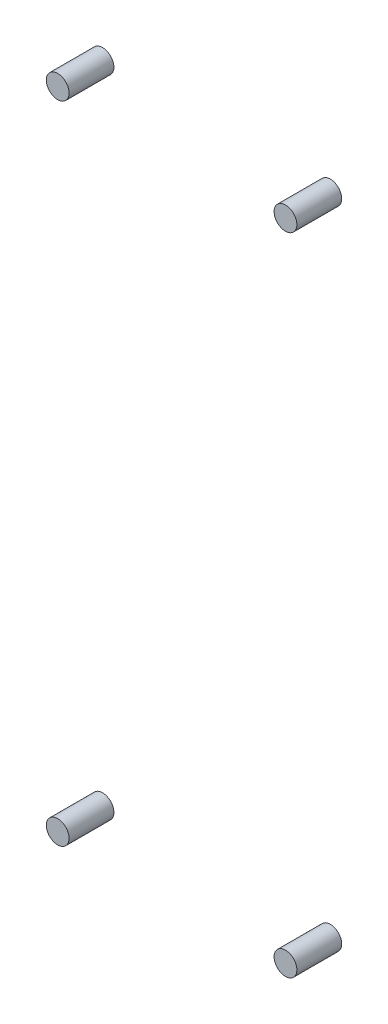
ISO-10303-21;
HEADER;
FILE_DESCRIPTION(('STEP AP214'),'2;1');
FILE_NAME('part.step','',(''),(''),'','','');
FILE_SCHEMA(('AUTOMOTIVE_DESIGN { 1 0 10303 214 1 1 1 1 }'));
ENDSEC;
DATA;
#1=APPLICATION_CONTEXT('core data for automotive mechanical design processes');
#2=APPLICATION_PROTOCOL_DEFINITION('international standard','automotive_design',2000,#1);
#3=PRODUCT_CONTEXT('',#1,'mechanical');
#4=PRODUCT('Part','Part','',(#3));
#5=PRODUCT_RELATED_PRODUCT_CATEGORY('part','',(#4));
#6=PRODUCT_DEFINITION_FORMATION('','',#4);
#7=PRODUCT_DEFINITION_CONTEXT('part definition',#1,'design');
#8=PRODUCT_DEFINITION('design','',#6,#7);
#9=PRODUCT_DEFINITION_SHAPE('','',#8);
#10=(LENGTH_UNIT() NAMED_UNIT(*) SI_UNIT(.MILLI.,.METRE.));
#11=(NAMED_UNIT(*) PLANE_ANGLE_UNIT() SI_UNIT($,.RADIAN.));
#12=(NAMED_UNIT(*) SI_UNIT($,.STERADIAN.) SOLID_ANGLE_UNIT());
#13=UNCERTAINTY_MEASURE_WITH_UNIT(LENGTH_MEASURE(1.E-05),#10,'distance_accuracy_value','');
#14=(GEOMETRIC_REPRESENTATION_CONTEXT(3) GLOBAL_UNCERTAINTY_ASSIGNED_CONTEXT((#13)) GLOBAL_UNIT_ASSIGNED_CONTEXT((#10,
#11,#12)) REPRESENTATION_CONTEXT('',''));
#15=CARTESIAN_POINT('',(0.,0.,0.));
#16=DIRECTION('',(0.,0.,1.));
#17=DIRECTION('',(1.,0.,0.));
#18=AXIS2_PLACEMENT_3D('',#15,#16,#17);
#19=CARTESIAN_POINT('',(-7.62,-21.59,3.));
#20=DIRECTION('',(0.,0.,-1.));
#21=DIRECTION('',(-1.,0.,0.));
#22=AXIS2_PLACEMENT_3D('',#19,#20,#21);
#23=CYLINDRICAL_SURFACE('',#22,0.761999999999999);
#24=CARTESIAN_POINT('',(-7.62,-21.59,3.));
#25=DIRECTION('',(0.,0.,1.));
#26=DIRECTION('',(-1.,0.,0.));
#27=AXIS2_PLACEMENT_3D('',#24,#25,#26);
#28=CIRCLE('',#27,0.761999999999999);
#29=CARTESIAN_POINT('',(-8.382,-21.59,3.));
#30=VERTEX_POINT('',#29);
#31=EDGE_CURVE('E11',#30,#30,#28,.T.);
#32=ORIENTED_EDGE('',*,*,#31,.F.);
#33=EDGE_LOOP('',(#32));
#34=FACE_BOUND('',#33,.T.);
#35=CARTESIAN_POINT('',(-7.62,-21.59,0.));
#36=DIRECTION('',(0.,0.,1.));
#37=DIRECTION('',(-1.,0.,0.));
#38=AXIS2_PLACEMENT_3D('',#35,#36,#37);
#39=CIRCLE('',#38,0.761999999999999);
#40=CARTESIAN_POINT('',(-8.382,-21.59,0.));
#41=VERTEX_POINT('',#40);
#42=EDGE_CURVE('E43',#41,#41,#39,.T.);
#43=ORIENTED_EDGE('',*,*,#42,.T.);
#44=EDGE_LOOP('',(#43));
#45=FACE_BOUND('',#44,.T.);
#46=ADVANCED_FACE('F40',(#34,#45),#23,.T.);
#47=CARTESIAN_POINT('',(-7.62,-21.59,3.));
#48=DIRECTION('',(0.,0.,-1.));
#49=DIRECTION('',(-1.,0.,0.));
#50=AXIS2_PLACEMENT_3D('',#47,#48,#49);
#51=PLANE('',#50);
#52=ORIENTED_EDGE('',*,*,#31,.T.);
#53=EDGE_LOOP('',(#52));
#54=FACE_BOUND('',#53,.T.);
#55=ADVANCED_FACE('F55',(#54),#51,.F.);
#56=CARTESIAN_POINT('',(-7.62,-21.59,0.));
#57=DIRECTION('',(0.,0.,-1.));
#58=DIRECTION('',(-1.,0.,0.));
#59=AXIS2_PLACEMENT_3D('',#56,#57,#58);
#60=PLANE('',#59);
#61=ORIENTED_EDGE('',*,*,#42,.F.);
#62=EDGE_LOOP('',(#61));
#63=FACE_BOUND('',#62,.T.);
#64=ADVANCED_FACE('F53',(#63),#60,.T.);
#65=CLOSED_SHELL('',(#46,#55,#64));
#66=MANIFOLD_SOLID_BREP('B2',#65);
#67=CARTESIAN_POINT('',(7.62,-21.59,3.));
#68=DIRECTION('',(0.,0.,-1.));
#69=DIRECTION('',(-1.,0.,0.));
#70=AXIS2_PLACEMENT_3D('',#67,#68,#69);
#71=CYLINDRICAL_SURFACE('',#70,0.762);
#72=CARTESIAN_POINT('',(7.62,-21.59,3.));
#73=DIRECTION('',(0.,0.,1.));
#74=DIRECTION('',(-1.,0.,0.));
#75=AXIS2_PLACEMENT_3D('',#72,#73,#74);
#76=CIRCLE('',#75,0.762);
#77=CARTESIAN_POINT('',(6.858,-21.59,3.));
#78=VERTEX_POINT('',#77);
#79=EDGE_CURVE('E39',#78,#78,#76,.T.);
#80=ORIENTED_EDGE('',*,*,#79,.F.);
#81=EDGE_LOOP('',(#80));
#82=FACE_BOUND('',#81,.T.);
#83=CARTESIAN_POINT('',(7.62,-21.59,0.));
#84=DIRECTION('',(0.,0.,1.));
#85=DIRECTION('',(-1.,0.,0.));
#86=AXIS2_PLACEMENT_3D('',#83,#84,#85);
#87=CIRCLE('',#86,0.762);
#88=CARTESIAN_POINT('',(6.858,-21.59,0.));
#89=VERTEX_POINT('',#88);
#90=EDGE_CURVE('E92',#89,#89,#87,.T.);
#91=ORIENTED_EDGE('',*,*,#90,.T.);
#92=EDGE_LOOP('',(#91));
#93=FACE_BOUND('',#92,.T.);
#94=ADVANCED_FACE('F89',(#82,#93),#71,.T.);
#95=CARTESIAN_POINT('',(7.62,-21.59,3.));
#96=DIRECTION('',(0.,0.,-1.));
#97=DIRECTION('',(-1.,0.,0.));
#98=AXIS2_PLACEMENT_3D('',#95,#96,#97);
#99=PLANE('',#98);
#100=ORIENTED_EDGE('',*,*,#79,.T.);
#101=EDGE_LOOP('',(#100));
#102=FACE_BOUND('',#101,.T.);
#103=ADVANCED_FACE('F104',(#102),#99,.F.);
#104=CARTESIAN_POINT('',(7.62,-21.59,0.));
#105=DIRECTION('',(0.,0.,-1.));
#106=DIRECTION('',(-1.,0.,0.));
#107=AXIS2_PLACEMENT_3D('',#104,#105,#106);
#108=PLANE('',#107);
#109=ORIENTED_EDGE('',*,*,#90,.F.);
#110=EDGE_LOOP('',(#109));
#111=FACE_BOUND('',#110,.T.);
#112=ADVANCED_FACE('F102',(#111),#108,.T.);
#113=CLOSED_SHELL('',(#94,#103,#112));
#114=MANIFOLD_SOLID_BREP('B6',#113);
#115=CARTESIAN_POINT('',(7.62,21.59,3.));
#116=DIRECTION('',(0.,0.,-1.));
#117=DIRECTION('',(-1.,0.,0.));
#118=AXIS2_PLACEMENT_3D('',#115,#116,#117);
#119=CYLINDRICAL_SURFACE('',#118,0.762);
#120=CARTESIAN_POINT('',(7.62,21.59,3.));
#121=DIRECTION('',(0.,0.,1.));
#122=DIRECTION('',(1.,0.,0.));
#123=AXIS2_PLACEMENT_3D('',#120,#121,#122);
#124=CIRCLE('',#123,0.762);
#125=CARTESIAN_POINT('',(8.382,21.59,3.));
#126=VERTEX_POINT('',#125);
#127=EDGE_CURVE('E88',#126,#126,#124,.T.);
#128=ORIENTED_EDGE('',*,*,#127,.F.);
#129=EDGE_LOOP('',(#128));
#130=FACE_BOUND('',#129,.T.);
#131=CARTESIAN_POINT('',(7.62,21.59,0.));
#132=DIRECTION('',(0.,0.,1.));
#133=DIRECTION('',(1.,0.,0.));
#134=AXIS2_PLACEMENT_3D('',#131,#132,#133);
#135=CIRCLE('',#134,0.762);
#136=CARTESIAN_POINT('',(8.382,21.59,0.));
#137=VERTEX_POINT('',#136);
#138=EDGE_CURVE('E140',#137,#137,#135,.T.);
#139=ORIENTED_EDGE('',*,*,#138,.T.);
#140=EDGE_LOOP('',(#139));
#141=FACE_BOUND('',#140,.T.);
#142=ADVANCED_FACE('F137',(#130,#141),#119,.T.);
#143=CARTESIAN_POINT('',(7.62,21.59,3.));
#144=DIRECTION('',(0.,0.,1.));
#145=DIRECTION('',(1.,0.,0.));
#146=AXIS2_PLACEMENT_3D('',#143,#144,#145);
#147=PLANE('',#146);
#148=ORIENTED_EDGE('',*,*,#127,.T.);
#149=EDGE_LOOP('',(#148));
#150=FACE_BOUND('',#149,.T.);
#151=ADVANCED_FACE('F152',(#150),#147,.T.);
#152=CARTESIAN_POINT('',(7.62,21.59,0.));
#153=DIRECTION('',(0.,0.,1.));
#154=DIRECTION('',(1.,0.,0.));
#155=AXIS2_PLACEMENT_3D('',#152,#153,#154);
#156=PLANE('',#155);
#157=ORIENTED_EDGE('',*,*,#138,.F.);
#158=EDGE_LOOP('',(#157));
#159=FACE_BOUND('',#158,.T.);
#160=ADVANCED_FACE('F150',(#159),#156,.F.);
#161=CLOSED_SHELL('',(#142,#151,#160));
#162=MANIFOLD_SOLID_BREP('B34',#161);
#163=CARTESIAN_POINT('',(-7.62,21.59,3.));
#164=DIRECTION('',(0.,0.,-1.));
#165=DIRECTION('',(-1.,0.,0.));
#166=AXIS2_PLACEMENT_3D('',#163,#164,#165);
#167=CYLINDRICAL_SURFACE('',#166,0.761999999999999);
#168=CARTESIAN_POINT('',(-7.62,21.59,3.));
#169=DIRECTION('',(0.,0.,1.));
#170=DIRECTION('',(1.,0.,0.));
#171=AXIS2_PLACEMENT_3D('',#168,#169,#170);
#172=CIRCLE('',#171,0.761999999999999);
#173=CARTESIAN_POINT('',(-6.858,21.59,3.));
#174=VERTEX_POINT('',#173);
#175=EDGE_CURVE('E136',#174,#174,#172,.T.);
#176=ORIENTED_EDGE('',*,*,#175,.F.);
#177=EDGE_LOOP('',(#176));
#178=FACE_BOUND('',#177,.T.);
#179=CARTESIAN_POINT('',(-7.62,21.59,0.));
#180=DIRECTION('',(0.,0.,1.));
#181=DIRECTION('',(1.,0.,0.));
#182=AXIS2_PLACEMENT_3D('',#179,#180,#181);
#183=CIRCLE('',#182,0.761999999999999);
#184=CARTESIAN_POINT('',(-6.858,21.59,0.));
#185=VERTEX_POINT('',#184);
#186=EDGE_CURVE('E181',#185,#185,#183,.T.);
#187=ORIENTED_EDGE('',*,*,#186,.T.);
#188=EDGE_LOOP('',(#187));
#189=FACE_BOUND('',#188,.T.);
#190=ADVANCED_FACE('F178',(#178,#189),#167,.T.);
#191=CARTESIAN_POINT('',(-7.62,21.59,3.));
#192=DIRECTION('',(0.,0.,1.));
#193=DIRECTION('',(1.,0.,0.));
#194=AXIS2_PLACEMENT_3D('',#191,#192,#193);
#195=PLANE('',#194);
#196=ORIENTED_EDGE('',*,*,#175,.T.);
#197=EDGE_LOOP('',(#196));
#198=FACE_BOUND('',#197,.T.);
#199=ADVANCED_FACE('F193',(#198),#195,.T.);
#200=CARTESIAN_POINT('',(-7.62,21.59,0.));
#201=DIRECTION('',(0.,0.,1.));
#202=DIRECTION('',(1.,0.,0.));
#203=AXIS2_PLACEMENT_3D('',#200,#201,#202);
#204=PLANE('',#203);
#205=ORIENTED_EDGE('',*,*,#186,.F.);
#206=EDGE_LOOP('',(#205));
#207=FACE_BOUND('',#206,.T.);
#208=ADVANCED_FACE('F191',(#207),#204,.F.);
#209=CLOSED_SHELL('',(#190,#199,#208));
#210=MANIFOLD_SOLID_BREP('B83',#209);
#211=ADVANCED_BREP_SHAPE_REPRESENTATION('',(#18,#66,#114,#162,#210),#14);
#212=SHAPE_DEFINITION_REPRESENTATION(#9,#211);
ENDSEC;
END-ISO-10303-21;
